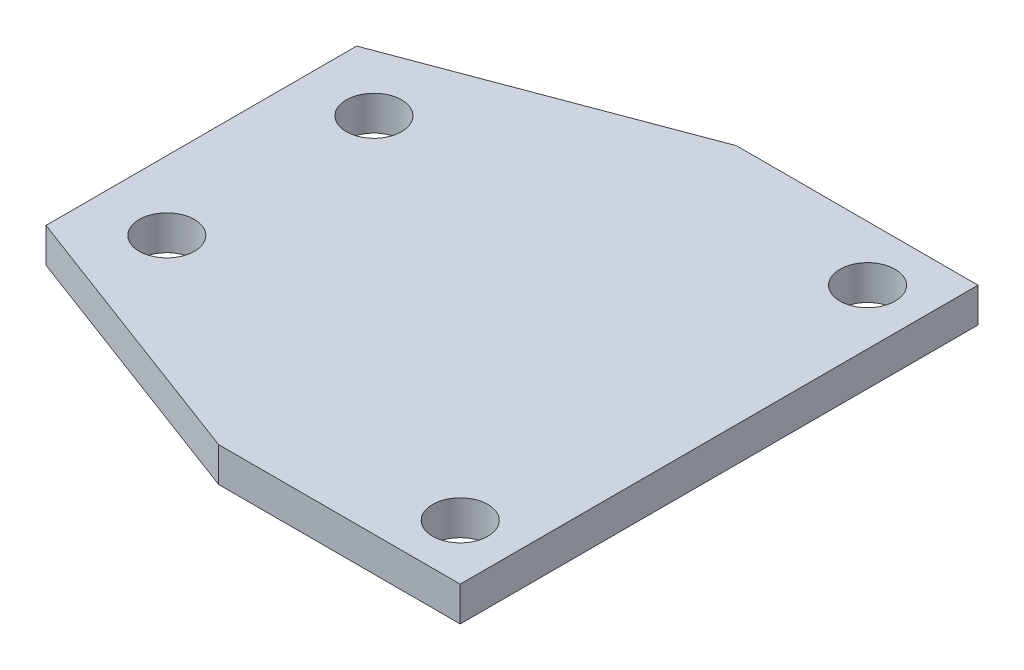
ISO-10303-21;
HEADER;
FILE_DESCRIPTION(('STEP AP214'),'2;1');
FILE_NAME('part.step','',(''),(''),'','','');
FILE_SCHEMA(('AUTOMOTIVE_DESIGN { 1 0 10303 214 1 1 1 1 }'));
ENDSEC;
DATA;
#1=APPLICATION_CONTEXT('core data for automotive mechanical design processes');
#2=APPLICATION_PROTOCOL_DEFINITION('international standard','automotive_design',2000,#1);
#3=PRODUCT_CONTEXT('',#1,'mechanical');
#4=PRODUCT('Part','Part','',(#3));
#5=PRODUCT_RELATED_PRODUCT_CATEGORY('part','',(#4));
#6=PRODUCT_DEFINITION_FORMATION('','',#4);
#7=PRODUCT_DEFINITION_CONTEXT('part definition',#1,'design');
#8=PRODUCT_DEFINITION('design','',#6,#7);
#9=PRODUCT_DEFINITION_SHAPE('','',#8);
#10=(LENGTH_UNIT() NAMED_UNIT(*) SI_UNIT(.MILLI.,.METRE.));
#11=(NAMED_UNIT(*) PLANE_ANGLE_UNIT() SI_UNIT($,.RADIAN.));
#12=(NAMED_UNIT(*) SI_UNIT($,.STERADIAN.) SOLID_ANGLE_UNIT());
#13=UNCERTAINTY_MEASURE_WITH_UNIT(LENGTH_MEASURE(1.E-05),#10,'distance_accuracy_value','');
#14=(GEOMETRIC_REPRESENTATION_CONTEXT(3) GLOBAL_UNCERTAINTY_ASSIGNED_CONTEXT((#13)) GLOBAL_UNIT_ASSIGNED_CONTEXT((#10,
#11,#12)) REPRESENTATION_CONTEXT('',''));
#15=CARTESIAN_POINT('',(0.,0.,0.));
#16=DIRECTION('',(0.,0.,1.));
#17=DIRECTION('',(1.,0.,0.));
#18=AXIS2_PLACEMENT_3D('',#15,#16,#17);
#19=CARTESIAN_POINT('',(0.,10.,0.));
#20=DIRECTION('',(1.,0.,0.));
#21=DIRECTION('',(0.,0.,-1.));
#22=AXIS2_PLACEMENT_3D('',#19,#20,#21);
#23=PLANE('',#22);
#24=DIRECTION('',(0.,0.,1.));
#25=VECTOR('',#24,1.);
#26=CARTESIAN_POINT('',(0.,10.,0.));
#27=LINE('',#26,#25);
#28=CARTESIAN_POINT('',(0.,10.,-120.));
#29=VERTEX_POINT('',#28);
#30=CARTESIAN_POINT('',(0.,10.,-30.));
#31=VERTEX_POINT('',#30);
#32=EDGE_CURVE('E97',#29,#31,#27,.T.);
#33=ORIENTED_EDGE('',*,*,#32,.F.);
#34=DIRECTION('',(0.,-1.,0.));
#35=VECTOR('',#34,1.);
#36=CARTESIAN_POINT('',(0.,10.,-120.));
#37=LINE('',#36,#35);
#38=CARTESIAN_POINT('',(0.,0.,-120.));
#39=VERTEX_POINT('',#38);
#40=EDGE_CURVE('E133',#29,#39,#37,.T.);
#41=ORIENTED_EDGE('',*,*,#40,.T.);
#42=DIRECTION('',(0.,0.,1.));
#43=VECTOR('',#42,1.);
#44=CARTESIAN_POINT('',(0.,0.,0.));
#45=LINE('',#44,#43);
#46=CARTESIAN_POINT('',(0.,0.,-30.));
#47=VERTEX_POINT('',#46);
#48=EDGE_CURVE('E116',#39,#47,#45,.T.);
#49=ORIENTED_EDGE('',*,*,#48,.T.);
#50=DIRECTION('',(0.,1.,0.));
#51=VECTOR('',#50,1.);
#52=CARTESIAN_POINT('',(0.,10.,-30.));
#53=LINE('',#52,#51);
#54=EDGE_CURVE('E129',#47,#31,#53,.T.);
#55=ORIENTED_EDGE('',*,*,#54,.T.);
#56=EDGE_LOOP('',(#33,#41,#49,#55));
#57=FACE_BOUND('',#56,.T.);
#58=ADVANCED_FACE('F34',(#57),#23,.F.);
#59=CARTESIAN_POINT('',(0.,10.,0.));
#60=DIRECTION('',(0.,0.,-1.));
#61=DIRECTION('',(-1.,0.,0.));
#62=AXIS2_PLACEMENT_3D('',#59,#60,#61);
#63=PLANE('',#62);
#64=DIRECTION('',(1.,0.,0.));
#65=VECTOR('',#64,1.);
#66=CARTESIAN_POINT('',(0.,10.,0.));
#67=LINE('',#66,#65);
#68=CARTESIAN_POINT('',(80.0000000000008,10.,0.));
#69=VERTEX_POINT('',#68);
#70=CARTESIAN_POINT('',(150.,10.,0.));
#71=VERTEX_POINT('',#70);
#72=EDGE_CURVE('E86',#69,#71,#67,.T.);
#73=ORIENTED_EDGE('',*,*,#72,.F.);
#74=DIRECTION('',(0.,-1.,0.));
#75=VECTOR('',#74,1.);
#76=CARTESIAN_POINT('',(80.0000000000008,10.,0.));
#77=LINE('',#76,#75);
#78=CARTESIAN_POINT('',(80.0000000000008,0.,0.));
#79=VERTEX_POINT('',#78);
#80=EDGE_CURVE('E106',#69,#79,#77,.T.);
#81=ORIENTED_EDGE('',*,*,#80,.T.);
#82=DIRECTION('',(1.,0.,0.));
#83=VECTOR('',#82,1.);
#84=CARTESIAN_POINT('',(0.,0.,0.));
#85=LINE('',#84,#83);
#86=CARTESIAN_POINT('',(150.,0.,0.));
#87=VERTEX_POINT('',#86);
#88=EDGE_CURVE('E103',#79,#87,#85,.T.);
#89=ORIENTED_EDGE('',*,*,#88,.T.);
#90=DIRECTION('',(0.,-1.,0.));
#91=VECTOR('',#90,1.);
#92=CARTESIAN_POINT('',(150.,10.,0.));
#93=LINE('',#92,#91);
#94=EDGE_CURVE('E100',#71,#87,#93,.T.);
#95=ORIENTED_EDGE('',*,*,#94,.F.);
#96=EDGE_LOOP('',(#73,#81,#89,#95));
#97=FACE_BOUND('',#96,.T.);
#98=ADVANCED_FACE('F101',(#97),#63,.F.);
#99=CARTESIAN_POINT('',(150.,10.,0.));
#100=DIRECTION('',(-1.,0.,0.));
#101=DIRECTION('',(0.,0.,1.));
#102=AXIS2_PLACEMENT_3D('',#99,#100,#101);
#103=PLANE('',#102);
#104=DIRECTION('',(0.,0.,-1.));
#105=VECTOR('',#104,1.);
#106=CARTESIAN_POINT('',(150.,0.,0.));
#107=LINE('',#106,#105);
#108=CARTESIAN_POINT('',(150.,0.,-150.));
#109=VERTEX_POINT('',#108);
#110=EDGE_CURVE('E120',#87,#109,#107,.T.);
#111=ORIENTED_EDGE('',*,*,#110,.T.);
#112=DIRECTION('',(0.,-1.,0.));
#113=VECTOR('',#112,1.);
#114=CARTESIAN_POINT('',(150.,10.,-150.));
#115=LINE('',#114,#113);
#116=CARTESIAN_POINT('',(150.,10.,-150.));
#117=VERTEX_POINT('',#116);
#118=EDGE_CURVE('E107',#117,#109,#115,.T.);
#119=ORIENTED_EDGE('',*,*,#118,.F.);
#120=DIRECTION('',(0.,0.,-1.));
#121=VECTOR('',#120,1.);
#122=CARTESIAN_POINT('',(150.,10.,0.));
#123=LINE('',#122,#121);
#124=EDGE_CURVE('E90',#71,#117,#123,.T.);
#125=ORIENTED_EDGE('',*,*,#124,.F.);
#126=ORIENTED_EDGE('',*,*,#94,.T.);
#127=EDGE_LOOP('',(#111,#119,#125,#126));
#128=FACE_BOUND('',#127,.T.);
#129=ADVANCED_FACE('F109',(#128),#103,.F.);
#130=CARTESIAN_POINT('',(0.,10.,-150.));
#131=DIRECTION('',(0.,0.,1.));
#132=DIRECTION('',(1.,0.,0.));
#133=AXIS2_PLACEMENT_3D('',#130,#131,#132);
#134=PLANE('',#133);
#135=DIRECTION('',(-1.,0.,0.));
#136=VECTOR('',#135,1.);
#137=CARTESIAN_POINT('',(0.,0.,-150.));
#138=LINE('',#137,#136);
#139=CARTESIAN_POINT('',(80.0000000000007,0.,-150.));
#140=VERTEX_POINT('',#139);
#141=EDGE_CURVE('E122',#109,#140,#138,.T.);
#142=ORIENTED_EDGE('',*,*,#141,.T.);
#143=DIRECTION('',(0.,1.,0.));
#144=VECTOR('',#143,1.);
#145=CARTESIAN_POINT('',(80.0000000000007,10.,-150.));
#146=LINE('',#145,#144);
#147=CARTESIAN_POINT('',(80.0000000000007,10.,-150.));
#148=VERTEX_POINT('',#147);
#149=EDGE_CURVE('E42',#140,#148,#146,.T.);
#150=ORIENTED_EDGE('',*,*,#149,.T.);
#151=DIRECTION('',(-1.,0.,0.));
#152=VECTOR('',#151,1.);
#153=CARTESIAN_POINT('',(0.,10.,-150.));
#154=LINE('',#153,#152);
#155=EDGE_CURVE('E111',#117,#148,#154,.T.);
#156=ORIENTED_EDGE('',*,*,#155,.F.);
#157=ORIENTED_EDGE('',*,*,#118,.T.);
#158=EDGE_LOOP('',(#142,#150,#156,#157));
#159=FACE_BOUND('',#158,.T.);
#160=ADVANCED_FACE('F162',(#159),#134,.F.);
#161=CARTESIAN_POINT('',(0.,10.,0.));
#162=DIRECTION('',(0.,-1.,0.));
#163=DIRECTION('',(0.,0.,-1.));
#164=AXIS2_PLACEMENT_3D('',#161,#162,#163);
#165=PLANE('',#164);
#166=CARTESIAN_POINT('',(20.,10.,-45.));
#167=DIRECTION('',(0.,1.,0.));
#168=DIRECTION('',(0.,0.,1.));
#169=AXIS2_PLACEMENT_3D('',#166,#167,#168);
#170=CIRCLE('',#169,8.);
#171=CARTESIAN_POINT('',(20.,10.,-37.));
#172=VERTEX_POINT('',#171);
#173=EDGE_CURVE('E190',#172,#172,#170,.T.);
#174=ORIENTED_EDGE('',*,*,#173,.F.);
#175=EDGE_LOOP('',(#174));
#176=FACE_BOUND('',#175,.T.);
#177=CARTESIAN_POINT('',(20.,10.,-105.));
#178=DIRECTION('',(0.,1.,0.));
#179=DIRECTION('',(0.,0.,1.));
#180=AXIS2_PLACEMENT_3D('',#177,#178,#179);
#181=CIRCLE('',#180,8.00000000000001);
#182=CARTESIAN_POINT('',(20.,10.,-97.));
#183=VERTEX_POINT('',#182);
#184=EDGE_CURVE('E192',#183,#183,#181,.T.);
#185=ORIENTED_EDGE('',*,*,#184,.F.);
#186=EDGE_LOOP('',(#185));
#187=FACE_BOUND('',#186,.T.);
#188=CARTESIAN_POINT('',(134.,10.,-16.));
#189=DIRECTION('',(0.,1.,0.));
#190=DIRECTION('',(0.,0.,1.));
#191=AXIS2_PLACEMENT_3D('',#188,#189,#190);
#192=CIRCLE('',#191,8.00000000000001);
#193=CARTESIAN_POINT('',(134.,10.,-7.99999999999998));
#194=VERTEX_POINT('',#193);
#195=EDGE_CURVE('E198',#194,#194,#192,.T.);
#196=ORIENTED_EDGE('',*,*,#195,.F.);
#197=EDGE_LOOP('',(#196));
#198=FACE_BOUND('',#197,.T.);
#199=CARTESIAN_POINT('',(134.,10.,-134.));
#200=DIRECTION('',(0.,1.,0.));
#201=DIRECTION('',(0.,0.,1.));
#202=AXIS2_PLACEMENT_3D('',#199,#200,#201);
#203=CIRCLE('',#202,8.00000000000001);
#204=CARTESIAN_POINT('',(134.,10.,-126.));
#205=VERTEX_POINT('',#204);
#206=EDGE_CURVE('E204',#205,#205,#203,.T.);
#207=ORIENTED_EDGE('',*,*,#206,.F.);
#208=EDGE_LOOP('',(#207));
#209=FACE_BOUND('',#208,.T.);
#210=ORIENTED_EDGE('',*,*,#155,.T.);
#211=DIRECTION('',(0.936329177569046,0.,-0.351123441588389));
#212=VECTOR('',#211,1.);
#213=CARTESIAN_POINT('',(0.,10.,-120.));
#214=LINE('',#213,#212);
#215=EDGE_CURVE('E11',#148,#29,#214,.F.);
#216=ORIENTED_EDGE('',*,*,#215,.T.);
#217=ORIENTED_EDGE('',*,*,#32,.T.);
#218=DIRECTION('',(-0.936329177569046,0.,-0.351123441588389));
#219=VECTOR('',#218,1.);
#220=CARTESIAN_POINT('',(80.0000000000008,10.,0.));
#221=LINE('',#220,#219);
#222=EDGE_CURVE('E93',#31,#69,#221,.F.);
#223=ORIENTED_EDGE('',*,*,#222,.T.);
#224=ORIENTED_EDGE('',*,*,#72,.T.);
#225=ORIENTED_EDGE('',*,*,#124,.T.);
#226=EDGE_LOOP('',(#210,#216,#217,#223,#224,#225));
#227=FACE_BOUND('',#226,.T.);
#228=ADVANCED_FACE('F88',(#176,#187,#198,#209,#227),#165,.F.);
#229=CARTESIAN_POINT('',(0.,0.,0.));
#230=DIRECTION('',(0.,-1.,0.));
#231=DIRECTION('',(0.,0.,-1.));
#232=AXIS2_PLACEMENT_3D('',#229,#230,#231);
#233=PLANE('',#232);
#234=CARTESIAN_POINT('',(20.,0.,-45.));
#235=DIRECTION('',(0.,1.,0.));
#236=DIRECTION('',(0.,0.,1.));
#237=AXIS2_PLACEMENT_3D('',#234,#235,#236);
#238=CIRCLE('',#237,8.);
#239=CARTESIAN_POINT('',(20.,0.,-37.));
#240=VERTEX_POINT('',#239);
#241=EDGE_CURVE('E187',#240,#240,#238,.T.);
#242=ORIENTED_EDGE('',*,*,#241,.T.);
#243=EDGE_LOOP('',(#242));
#244=FACE_BOUND('',#243,.T.);
#245=CARTESIAN_POINT('',(20.,0.,-105.));
#246=DIRECTION('',(0.,1.,0.));
#247=DIRECTION('',(0.,0.,1.));
#248=AXIS2_PLACEMENT_3D('',#245,#246,#247);
#249=CIRCLE('',#248,8.00000000000001);
#250=CARTESIAN_POINT('',(20.,0.,-97.));
#251=VERTEX_POINT('',#250);
#252=EDGE_CURVE('E195',#251,#251,#249,.T.);
#253=ORIENTED_EDGE('',*,*,#252,.T.);
#254=EDGE_LOOP('',(#253));
#255=FACE_BOUND('',#254,.T.);
#256=CARTESIAN_POINT('',(134.,0.,-16.));
#257=DIRECTION('',(0.,1.,0.));
#258=DIRECTION('',(0.,0.,1.));
#259=AXIS2_PLACEMENT_3D('',#256,#257,#258);
#260=CIRCLE('',#259,8.00000000000001);
#261=CARTESIAN_POINT('',(134.,0.,-7.99999999999998));
#262=VERTEX_POINT('',#261);
#263=EDGE_CURVE('E201',#262,#262,#260,.T.);
#264=ORIENTED_EDGE('',*,*,#263,.T.);
#265=EDGE_LOOP('',(#264));
#266=FACE_BOUND('',#265,.T.);
#267=CARTESIAN_POINT('',(134.,0.,-134.));
#268=DIRECTION('',(0.,1.,0.));
#269=DIRECTION('',(0.,0.,1.));
#270=AXIS2_PLACEMENT_3D('',#267,#268,#269);
#271=CIRCLE('',#270,8.00000000000001);
#272=CARTESIAN_POINT('',(134.,0.,-126.));
#273=VERTEX_POINT('',#272);
#274=EDGE_CURVE('E118',#273,#273,#271,.T.);
#275=ORIENTED_EDGE('',*,*,#274,.T.);
#276=EDGE_LOOP('',(#275));
#277=FACE_BOUND('',#276,.T.);
#278=ORIENTED_EDGE('',*,*,#48,.F.);
#279=DIRECTION('',(-0.936329177569046,0.,0.351123441588389));
#280=VECTOR('',#279,1.);
#281=CARTESIAN_POINT('',(-39.4520547945203,0.,-105.205479452055));
#282=LINE('',#281,#280);
#283=EDGE_CURVE('E56',#39,#140,#282,.F.);
#284=ORIENTED_EDGE('',*,*,#283,.T.);
#285=ORIENTED_EDGE('',*,*,#141,.F.);
#286=ORIENTED_EDGE('',*,*,#110,.F.);
#287=ORIENTED_EDGE('',*,*,#88,.F.);
#288=DIRECTION('',(0.936329177569046,0.,0.351123441588389));
#289=VECTOR('',#288,1.);
#290=CARTESIAN_POINT('',(9.86301369863009,0.,-26.3013698630138));
#291=LINE('',#290,#289);
#292=EDGE_CURVE('E126',#79,#47,#291,.F.);
#293=ORIENTED_EDGE('',*,*,#292,.T.);
#294=EDGE_LOOP('',(#278,#284,#285,#286,#287,#293));
#295=FACE_BOUND('',#294,.T.);
#296=ADVANCED_FACE('F141',(#244,#255,#266,#277,#295),#233,.T.);
#297=CARTESIAN_POINT('',(80.0000000000008,10.,0.));
#298=DIRECTION('',(0.351123441588389,0.,-0.936329177569046));
#299=DIRECTION('',(0.,-1.,0.));
#300=AXIS2_PLACEMENT_3D('',#297,#298,#299);
#301=PLANE('',#300);
#302=ORIENTED_EDGE('',*,*,#222,.F.);
#303=ORIENTED_EDGE('',*,*,#54,.F.);
#304=ORIENTED_EDGE('',*,*,#292,.F.);
#305=ORIENTED_EDGE('',*,*,#80,.F.);
#306=EDGE_LOOP('',(#302,#303,#304,#305));
#307=FACE_BOUND('',#306,.T.);
#308=ADVANCED_FACE('F144',(#307),#301,.F.);
#309=CARTESIAN_POINT('',(0.,10.,-120.));
#310=DIRECTION('',(0.351123441588389,0.,0.936329177569046));
#311=DIRECTION('',(0.,-1.,0.));
#312=AXIS2_PLACEMENT_3D('',#309,#310,#311);
#313=PLANE('',#312);
#314=ORIENTED_EDGE('',*,*,#215,.F.);
#315=ORIENTED_EDGE('',*,*,#149,.F.);
#316=ORIENTED_EDGE('',*,*,#283,.F.);
#317=ORIENTED_EDGE('',*,*,#40,.F.);
#318=EDGE_LOOP('',(#314,#315,#316,#317));
#319=FACE_BOUND('',#318,.T.);
#320=ADVANCED_FACE('F36',(#319),#313,.F.);
#321=CARTESIAN_POINT('',(134.,0.,-134.));
#322=DIRECTION('',(0.,1.,0.));
#323=DIRECTION('',(0.,0.,1.));
#324=AXIS2_PLACEMENT_3D('',#321,#322,#323);
#325=CYLINDRICAL_SURFACE('',#324,8.00000000000001);
#326=ORIENTED_EDGE('',*,*,#274,.F.);
#327=EDGE_LOOP('',(#326));
#328=FACE_BOUND('',#327,.T.);
#329=ORIENTED_EDGE('',*,*,#206,.T.);
#330=EDGE_LOOP('',(#329));
#331=FACE_BOUND('',#330,.T.);
#332=ADVANCED_FACE('F150',(#328,#331),#325,.F.);
#333=CARTESIAN_POINT('',(134.,0.,-16.));
#334=DIRECTION('',(0.,1.,0.));
#335=DIRECTION('',(0.,0.,1.));
#336=AXIS2_PLACEMENT_3D('',#333,#334,#335);
#337=CYLINDRICAL_SURFACE('',#336,8.00000000000001);
#338=ORIENTED_EDGE('',*,*,#263,.F.);
#339=EDGE_LOOP('',(#338));
#340=FACE_BOUND('',#339,.T.);
#341=ORIENTED_EDGE('',*,*,#195,.T.);
#342=EDGE_LOOP('',(#341));
#343=FACE_BOUND('',#342,.T.);
#344=ADVANCED_FACE('F170',(#340,#343),#337,.F.);
#345=CARTESIAN_POINT('',(20.,0.,-105.));
#346=DIRECTION('',(0.,1.,0.));
#347=DIRECTION('',(0.,0.,1.));
#348=AXIS2_PLACEMENT_3D('',#345,#346,#347);
#349=CYLINDRICAL_SURFACE('',#348,8.00000000000001);
#350=ORIENTED_EDGE('',*,*,#252,.F.);
#351=EDGE_LOOP('',(#350));
#352=FACE_BOUND('',#351,.T.);
#353=ORIENTED_EDGE('',*,*,#184,.T.);
#354=EDGE_LOOP('',(#353));
#355=FACE_BOUND('',#354,.T.);
#356=ADVANCED_FACE('F174',(#352,#355),#349,.F.);
#357=CARTESIAN_POINT('',(20.,0.,-45.));
#358=DIRECTION('',(0.,1.,0.));
#359=DIRECTION('',(0.,0.,1.));
#360=AXIS2_PLACEMENT_3D('',#357,#358,#359);
#361=CYLINDRICAL_SURFACE('',#360,8.);
#362=ORIENTED_EDGE('',*,*,#241,.F.);
#363=EDGE_LOOP('',(#362));
#364=FACE_BOUND('',#363,.T.);
#365=ORIENTED_EDGE('',*,*,#173,.T.);
#366=EDGE_LOOP('',(#365));
#367=FACE_BOUND('',#366,.T.);
#368=ADVANCED_FACE('F178',(#364,#367),#361,.F.);
#369=CLOSED_SHELL('',(#58,#98,#129,#160,#228,#296,#308,#320,#332,#344,#356,#368));
#370=MANIFOLD_SOLID_BREP('B2',#369);
#371=ADVANCED_BREP_SHAPE_REPRESENTATION('',(#18,#370),#14);
#372=SHAPE_DEFINITION_REPRESENTATION(#9,#371);
ENDSEC;
END-ISO-10303-21;
